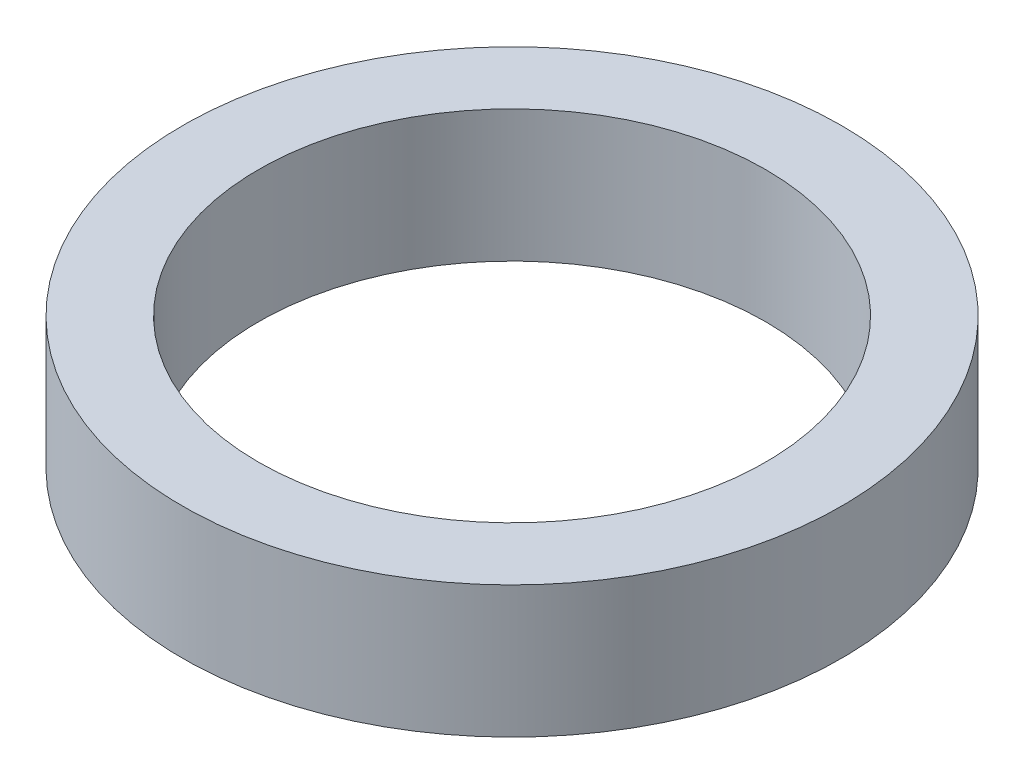
ISO-10303-21;
HEADER;
FILE_DESCRIPTION(('STEP AP214'),'2;1');
FILE_NAME('part.step','',(''),(''),'','','');
FILE_SCHEMA(('AUTOMOTIVE_DESIGN { 1 0 10303 214 1 1 1 1 }'));
ENDSEC;
DATA;
#1=APPLICATION_CONTEXT('core data for automotive mechanical design processes');
#2=APPLICATION_PROTOCOL_DEFINITION('international standard','automotive_design',2000,#1);
#3=PRODUCT_CONTEXT('',#1,'mechanical');
#4=PRODUCT('Part','Part','',(#3));
#5=PRODUCT_RELATED_PRODUCT_CATEGORY('part','',(#4));
#6=PRODUCT_DEFINITION_FORMATION('','',#4);
#7=PRODUCT_DEFINITION_CONTEXT('part definition',#1,'design');
#8=PRODUCT_DEFINITION('design','',#6,#7);
#9=PRODUCT_DEFINITION_SHAPE('','',#8);
#10=(LENGTH_UNIT() NAMED_UNIT(*) SI_UNIT(.MILLI.,.METRE.));
#11=(NAMED_UNIT(*) PLANE_ANGLE_UNIT() SI_UNIT($,.RADIAN.));
#12=(NAMED_UNIT(*) SI_UNIT($,.STERADIAN.) SOLID_ANGLE_UNIT());
#13=UNCERTAINTY_MEASURE_WITH_UNIT(LENGTH_MEASURE(1.E-05),#10,'distance_accuracy_value','');
#14=(GEOMETRIC_REPRESENTATION_CONTEXT(3) GLOBAL_UNCERTAINTY_ASSIGNED_CONTEXT((#13)) GLOBAL_UNIT_ASSIGNED_CONTEXT((#10,
#11,#12)) REPRESENTATION_CONTEXT('',''));
#15=CARTESIAN_POINT('',(0.,0.,0.));
#16=DIRECTION('',(0.,0.,1.));
#17=DIRECTION('',(1.,0.,0.));
#18=AXIS2_PLACEMENT_3D('',#15,#16,#17);
#19=CARTESIAN_POINT('',(0.,26.,0.));
#20=DIRECTION('',(0.,-1.,0.));
#21=DIRECTION('',(0.,0.,-1.));
#22=AXIS2_PLACEMENT_3D('',#19,#20,#21);
#23=CYLINDRICAL_SURFACE('',#22,65.);
#24=CARTESIAN_POINT('',(0.,26.,0.));
#25=DIRECTION('',(0.,1.,0.));
#26=DIRECTION('',(0.,0.,1.));
#27=AXIS2_PLACEMENT_3D('',#24,#25,#26);
#28=CIRCLE('',#27,65.);
#29=CARTESIAN_POINT('',(0.,26.,-65.));
#30=VERTEX_POINT('',#29);
#31=EDGE_CURVE('E10',#30,#30,#28,.T.);
#32=CARTESIAN_POINT('',(0.,0.,0.));
#33=DIRECTION('',(0.,1.,0.));
#34=DIRECTION('',(0.,0.,1.));
#35=AXIS2_PLACEMENT_3D('',#32,#33,#34);
#36=CIRCLE('',#35,65.);
#37=CARTESIAN_POINT('',(0.,0.,-65.));
#38=VERTEX_POINT('',#37);
#39=EDGE_CURVE('E37',#38,#38,#36,.T.);
#40=CARTESIAN_POINT('',(0.,26.,-65.));
#41=CARTESIAN_POINT('',(0.,25.7291666666667,-65.));
#42=CARTESIAN_POINT('',(0.,25.4583333333333,-65.));
#43=CARTESIAN_POINT('',(0.,24.9166666666667,-65.));
#44=CARTESIAN_POINT('',(0.,24.6458333333333,-65.));
#45=CARTESIAN_POINT('',(0.,24.1041666666667,-65.));
#46=CARTESIAN_POINT('',(0.,23.8333333333333,-65.));
#47=CARTESIAN_POINT('',(0.,23.2916666666667,-65.));
#48=CARTESIAN_POINT('',(0.,23.0208333333333,-65.));
#49=CARTESIAN_POINT('',(0.,22.4791666666667,-65.));
#50=CARTESIAN_POINT('',(0.,22.2083333333333,-65.));
#51=CARTESIAN_POINT('',(0.,21.6666666666667,-65.));
#52=CARTESIAN_POINT('',(0.,21.3958333333333,-65.));
#53=CARTESIAN_POINT('',(0.,20.8541666666667,-65.));
#54=CARTESIAN_POINT('',(0.,20.5833333333333,-65.));
#55=CARTESIAN_POINT('',(0.,20.0416666666667,-65.));
#56=CARTESIAN_POINT('',(0.,19.7708333333333,-65.));
#57=CARTESIAN_POINT('',(0.,19.2291666666667,-65.));
#58=CARTESIAN_POINT('',(0.,18.9583333333333,-65.));
#59=CARTESIAN_POINT('',(0.,18.4166666666667,-65.));
#60=CARTESIAN_POINT('',(0.,18.1458333333333,-65.));
#61=CARTESIAN_POINT('',(0.,17.6041666666667,-65.));
#62=CARTESIAN_POINT('',(0.,17.3333333333333,-65.));
#63=CARTESIAN_POINT('',(0.,16.7916666666667,-65.));
#64=CARTESIAN_POINT('',(0.,16.5208333333333,-65.));
#65=CARTESIAN_POINT('',(0.,15.9791666666667,-65.));
#66=CARTESIAN_POINT('',(0.,15.7083333333333,-65.));
#67=CARTESIAN_POINT('',(0.,15.1666666666667,-65.));
#68=CARTESIAN_POINT('',(0.,14.8958333333333,-65.));
#69=CARTESIAN_POINT('',(0.,14.3541666666667,-65.));
#70=CARTESIAN_POINT('',(0.,14.0833333333333,-65.));
#71=CARTESIAN_POINT('',(0.,13.5416666666667,-65.));
#72=CARTESIAN_POINT('',(0.,13.2708333333333,-65.));
#73=CARTESIAN_POINT('',(0.,12.7291666666667,-65.));
#74=CARTESIAN_POINT('',(0.,12.4583333333333,-65.));
#75=CARTESIAN_POINT('',(0.,11.9166666666667,-65.));
#76=CARTESIAN_POINT('',(0.,11.6458333333333,-65.));
#77=CARTESIAN_POINT('',(0.,11.1041666666667,-65.));
#78=CARTESIAN_POINT('',(0.,10.8333333333333,-65.));
#79=CARTESIAN_POINT('',(0.,10.2916666666667,-65.));
#80=CARTESIAN_POINT('',(0.,10.0208333333333,-65.));
#81=CARTESIAN_POINT('',(0.,9.47916666666667,-65.));
#82=CARTESIAN_POINT('',(0.,9.20833333333333,-65.));
#83=CARTESIAN_POINT('',(0.,8.66666666666667,-65.));
#84=CARTESIAN_POINT('',(0.,8.39583333333333,-65.));
#85=CARTESIAN_POINT('',(0.,7.85416666666667,-65.));
#86=CARTESIAN_POINT('',(0.,7.58333333333333,-65.));
#87=CARTESIAN_POINT('',(0.,7.04166666666667,-65.));
#88=CARTESIAN_POINT('',(0.,6.77083333333333,-65.));
#89=CARTESIAN_POINT('',(0.,6.22916666666667,-65.));
#90=CARTESIAN_POINT('',(0.,5.95833333333333,-65.));
#91=CARTESIAN_POINT('',(0.,5.41666666666667,-65.));
#92=CARTESIAN_POINT('',(0.,5.14583333333333,-65.));
#93=CARTESIAN_POINT('',(0.,4.60416666666667,-65.));
#94=CARTESIAN_POINT('',(0.,4.33333333333333,-65.));
#95=CARTESIAN_POINT('',(0.,3.79166666666667,-65.));
#96=CARTESIAN_POINT('',(0.,3.52083333333333,-65.));
#97=CARTESIAN_POINT('',(0.,2.97916666666667,-65.));
#98=CARTESIAN_POINT('',(0.,2.70833333333333,-65.));
#99=CARTESIAN_POINT('',(0.,2.16666666666667,-65.));
#100=CARTESIAN_POINT('',(0.,1.89583333333333,-65.));
#101=CARTESIAN_POINT('',(0.,1.35416666666667,-65.));
#102=CARTESIAN_POINT('',(0.,1.08333333333333,-65.));
#103=CARTESIAN_POINT('',(0.,0.541666666666667,-65.));
#104=CARTESIAN_POINT('',(0.,0.270833333333334,-65.));
#105=CARTESIAN_POINT('',(0.,0.,-65.));
#106=B_SPLINE_CURVE_WITH_KNOTS('',3,(#40,#41,#42,#43,#44,#45,#46,#47,#48,#49,#50,#51,#52,#53,
#54,#55,#56,#57,#58,#59,#60,#61,#62,#63,#64,#65,#66,#67,#68,#69,#70,#71,#72,#73,#74,#75,#76,#77,
#78,#79,#80,#81,#82,#83,#84,#85,#86,#87,#88,#89,#90,#91,#92,#93,#94,#95,#96,#97,#98,#99,#100,
#101,#102,#103,#104,#105),.UNSPECIFIED.,.F.,.F.,(4,2,2,2,2,2,2,2,2,2,2,2,2,2,2,2,2,2,2,2,2,2,2,
2,2,2,2,2,2,2,2,2,4),(0.,0.812499999999997,1.625,2.4375,3.25,4.0625,4.875,5.6875,6.5,7.3125,
8.125,8.93749999999999,9.74999999999999,10.5625,11.375,12.1875,13.,13.8125,14.625,15.4375,16.25,
17.0625,17.875,18.6875,19.5,20.3125,21.125,21.9375,22.75,23.5625,24.375,25.1875,26.),.UNSPECIFIED.);
#107=EDGE_CURVE('BSEAM40',#30,#38,#106,.T.);
#108=ORIENTED_EDGE('',*,*,#31,.F.);
#109=ORIENTED_EDGE('',*,*,#39,.T.);
#110=ORIENTED_EDGE('',*,*,#107,.T.);
#111=ORIENTED_EDGE('',*,*,#107,.F.);
#112=EDGE_LOOP('',(#108,#110,#109,#111));
#113=FACE_BOUND('',#112,.T.);
#114=ADVANCED_FACE('F40',(#113),#23,.T.);
#115=CARTESIAN_POINT('',(0.,26.,0.));
#116=DIRECTION('',(0.,1.,0.));
#117=DIRECTION('',(0.,0.,1.));
#118=AXIS2_PLACEMENT_3D('',#115,#116,#117);
#119=PLANE('',#118);
#120=CARTESIAN_POINT('',(0.,26.,0.));
#121=DIRECTION('',(0.,1.,0.));
#122=DIRECTION('',(0.,0.,1.));
#123=AXIS2_PLACEMENT_3D('',#120,#121,#122);
#124=CIRCLE('',#123,50.);
#125=CARTESIAN_POINT('',(0.,26.,-50.));
#126=VERTEX_POINT('',#125);
#127=EDGE_CURVE('E50',#126,#126,#124,.T.);
#128=ORIENTED_EDGE('',*,*,#127,.F.);
#129=EDGE_LOOP('',(#128));
#130=FACE_BOUND('',#129,.T.);
#131=ORIENTED_EDGE('',*,*,#31,.T.);
#132=EDGE_LOOP('',(#131));
#133=FACE_BOUND('',#132,.T.);
#134=ADVANCED_FACE('F59',(#130,#133),#119,.T.);
#135=CARTESIAN_POINT('',(0.,0.,0.));
#136=DIRECTION('',(0.,1.,0.));
#137=DIRECTION('',(0.,0.,1.));
#138=AXIS2_PLACEMENT_3D('',#135,#136,#137);
#139=PLANE('',#138);
#140=CARTESIAN_POINT('',(0.,0.,0.));
#141=DIRECTION('',(0.,1.,0.));
#142=DIRECTION('',(0.,0.,1.));
#143=AXIS2_PLACEMENT_3D('',#140,#141,#142);
#144=CIRCLE('',#143,50.);
#145=CARTESIAN_POINT('',(0.,0.,-50.));
#146=VERTEX_POINT('',#145);
#147=EDGE_CURVE('E47',#146,#146,#144,.T.);
#148=ORIENTED_EDGE('',*,*,#147,.T.);
#149=EDGE_LOOP('',(#148));
#150=FACE_BOUND('',#149,.T.);
#151=ORIENTED_EDGE('',*,*,#39,.F.);
#152=EDGE_LOOP('',(#151));
#153=FACE_BOUND('',#152,.T.);
#154=ADVANCED_FACE('F58',(#150,#153),#139,.F.);
#155=CARTESIAN_POINT('',(0.,26.,0.));
#156=DIRECTION('',(0.,-1.,0.));
#157=DIRECTION('',(0.,0.,-1.));
#158=AXIS2_PLACEMENT_3D('',#155,#156,#157);
#159=CYLINDRICAL_SURFACE('',#158,50.);
#160=CARTESIAN_POINT('',(0.,26.,-50.));
#161=CARTESIAN_POINT('',(0.,25.7291666666667,-50.));
#162=CARTESIAN_POINT('',(0.,25.4583333333333,-50.));
#163=CARTESIAN_POINT('',(0.,24.9166666666667,-50.));
#164=CARTESIAN_POINT('',(0.,24.6458333333333,-50.));
#165=CARTESIAN_POINT('',(0.,24.1041666666667,-50.));
#166=CARTESIAN_POINT('',(0.,23.8333333333333,-50.));
#167=CARTESIAN_POINT('',(0.,23.2916666666667,-50.));
#168=CARTESIAN_POINT('',(0.,23.0208333333333,-50.));
#169=CARTESIAN_POINT('',(0.,22.4791666666667,-50.));
#170=CARTESIAN_POINT('',(0.,22.2083333333333,-50.));
#171=CARTESIAN_POINT('',(0.,21.6666666666667,-50.));
#172=CARTESIAN_POINT('',(0.,21.3958333333333,-50.));
#173=CARTESIAN_POINT('',(0.,20.8541666666667,-50.));
#174=CARTESIAN_POINT('',(0.,20.5833333333333,-50.));
#175=CARTESIAN_POINT('',(0.,20.0416666666667,-50.));
#176=CARTESIAN_POINT('',(0.,19.7708333333333,-50.));
#177=CARTESIAN_POINT('',(0.,19.2291666666667,-50.));
#178=CARTESIAN_POINT('',(0.,18.9583333333333,-50.));
#179=CARTESIAN_POINT('',(0.,18.4166666666667,-50.));
#180=CARTESIAN_POINT('',(0.,18.1458333333333,-50.));
#181=CARTESIAN_POINT('',(0.,17.6041666666667,-50.));
#182=CARTESIAN_POINT('',(0.,17.3333333333333,-50.));
#183=CARTESIAN_POINT('',(0.,16.7916666666667,-50.));
#184=CARTESIAN_POINT('',(0.,16.5208333333333,-50.));
#185=CARTESIAN_POINT('',(0.,15.9791666666667,-50.));
#186=CARTESIAN_POINT('',(0.,15.7083333333333,-50.));
#187=CARTESIAN_POINT('',(0.,15.1666666666667,-50.));
#188=CARTESIAN_POINT('',(0.,14.8958333333333,-50.));
#189=CARTESIAN_POINT('',(0.,14.3541666666667,-50.));
#190=CARTESIAN_POINT('',(0.,14.0833333333333,-50.));
#191=CARTESIAN_POINT('',(0.,13.5416666666667,-50.));
#192=CARTESIAN_POINT('',(0.,13.2708333333333,-50.));
#193=CARTESIAN_POINT('',(0.,12.7291666666667,-50.));
#194=CARTESIAN_POINT('',(0.,12.4583333333333,-50.));
#195=CARTESIAN_POINT('',(0.,11.9166666666667,-50.));
#196=CARTESIAN_POINT('',(0.,11.6458333333333,-50.));
#197=CARTESIAN_POINT('',(0.,11.1041666666667,-50.));
#198=CARTESIAN_POINT('',(0.,10.8333333333333,-50.));
#199=CARTESIAN_POINT('',(0.,10.2916666666667,-50.));
#200=CARTESIAN_POINT('',(0.,10.0208333333333,-50.));
#201=CARTESIAN_POINT('',(0.,9.47916666666667,-50.));
#202=CARTESIAN_POINT('',(0.,9.20833333333333,-50.));
#203=CARTESIAN_POINT('',(0.,8.66666666666667,-50.));
#204=CARTESIAN_POINT('',(0.,8.39583333333333,-50.));
#205=CARTESIAN_POINT('',(0.,7.85416666666667,-50.));
#206=CARTESIAN_POINT('',(0.,7.58333333333333,-50.));
#207=CARTESIAN_POINT('',(0.,7.04166666666667,-50.));
#208=CARTESIAN_POINT('',(0.,6.77083333333333,-50.));
#209=CARTESIAN_POINT('',(0.,6.22916666666667,-50.));
#210=CARTESIAN_POINT('',(0.,5.95833333333333,-50.));
#211=CARTESIAN_POINT('',(0.,5.41666666666667,-50.));
#212=CARTESIAN_POINT('',(0.,5.14583333333333,-50.));
#213=CARTESIAN_POINT('',(0.,4.60416666666667,-50.));
#214=CARTESIAN_POINT('',(0.,4.33333333333333,-50.));
#215=CARTESIAN_POINT('',(0.,3.79166666666667,-50.));
#216=CARTESIAN_POINT('',(0.,3.52083333333333,-50.));
#217=CARTESIAN_POINT('',(0.,2.97916666666667,-50.));
#218=CARTESIAN_POINT('',(0.,2.70833333333333,-50.));
#219=CARTESIAN_POINT('',(0.,2.16666666666667,-50.));
#220=CARTESIAN_POINT('',(0.,1.89583333333333,-50.));
#221=CARTESIAN_POINT('',(0.,1.35416666666667,-50.));
#222=CARTESIAN_POINT('',(0.,1.08333333333333,-50.));
#223=CARTESIAN_POINT('',(0.,0.541666666666667,-50.));
#224=CARTESIAN_POINT('',(0.,0.270833333333334,-50.));
#225=CARTESIAN_POINT('',(0.,0.,-50.));
#226=B_SPLINE_CURVE_WITH_KNOTS('',3,(#160,#161,#162,#163,#164,#165,#166,#167,#168,#169,#170,
#171,#172,#173,#174,#175,#176,#177,#178,#179,#180,#181,#182,#183,#184,#185,#186,#187,#188,#189,
#190,#191,#192,#193,#194,#195,#196,#197,#198,#199,#200,#201,#202,#203,#204,#205,#206,#207,#208,
#209,#210,#211,#212,#213,#214,#215,#216,#217,#218,#219,#220,#221,#222,#223,#224,#225),
.UNSPECIFIED.,.F.,.F.,(4,2,2,2,2,2,2,2,2,2,2,2,2,2,2,2,2,2,2,2,2,2,2,2,2,2,2,2,2,2,2,2,4),(0.,
0.812499999999997,1.625,2.4375,3.25,4.0625,4.875,5.6875,6.5,7.3125,8.125,8.93749999999999,
9.74999999999999,10.5625,11.375,12.1875,13.,13.8125,14.625,15.4375,16.25,17.0625,17.875,18.6875,
19.5,20.3125,21.125,21.9375,22.75,23.5625,24.375,25.1875,26.),.UNSPECIFIED.);
#227=EDGE_CURVE('BSEAM54',#126,#146,#226,.T.);
#228=ORIENTED_EDGE('',*,*,#127,.T.);
#229=ORIENTED_EDGE('',*,*,#147,.F.);
#230=ORIENTED_EDGE('',*,*,#227,.T.);
#231=ORIENTED_EDGE('',*,*,#227,.F.);
#232=EDGE_LOOP('',(#228,#230,#229,#231));
#233=FACE_BOUND('',#232,.T.);
#234=ADVANCED_FACE('F54',(#233),#159,.F.);
#235=CLOSED_SHELL('',(#114,#134,#154,#234));
#236=MANIFOLD_SOLID_BREP('B2',#235);
#237=ADVANCED_BREP_SHAPE_REPRESENTATION('',(#18,#236),#14);
#238=SHAPE_DEFINITION_REPRESENTATION(#9,#237);
ENDSEC;
END-ISO-10303-21;
